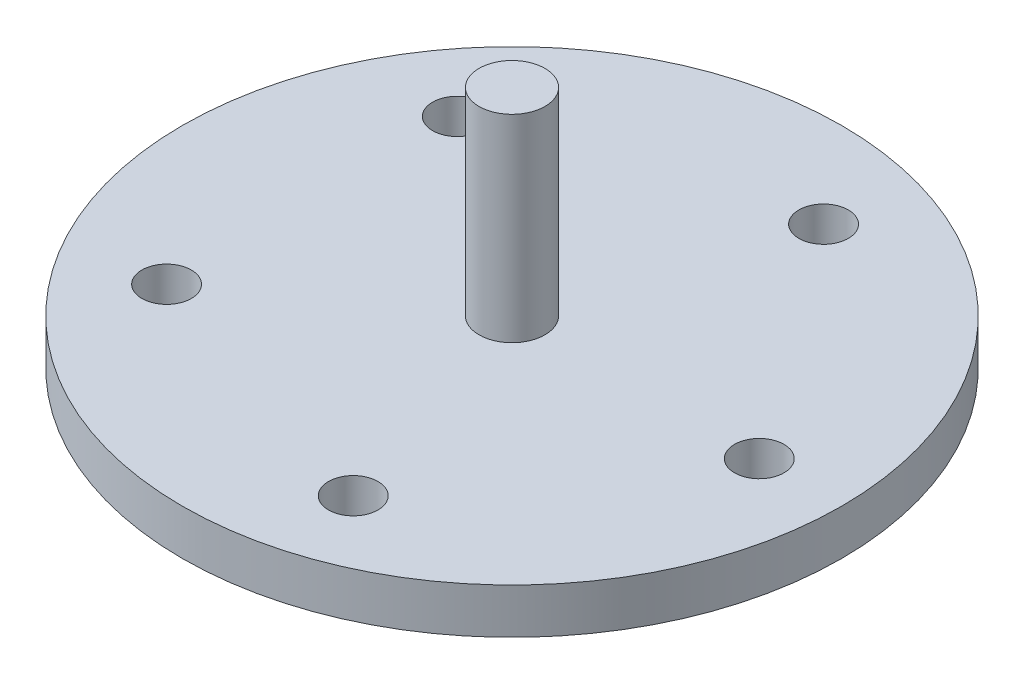
ISO-10303-21;
HEADER;
FILE_DESCRIPTION(('STEP AP214'),'2;1');
FILE_NAME('part.step','',(''),(''),'','','');
FILE_SCHEMA(('AUTOMOTIVE_DESIGN { 1 0 10303 214 1 1 1 1 }'));
ENDSEC;
DATA;
#1=APPLICATION_CONTEXT('core data for automotive mechanical design processes');
#2=APPLICATION_PROTOCOL_DEFINITION('international standard','automotive_design',2000,#1);
#3=PRODUCT_CONTEXT('',#1,'mechanical');
#4=PRODUCT('Part','Part','',(#3));
#5=PRODUCT_RELATED_PRODUCT_CATEGORY('part','',(#4));
#6=PRODUCT_DEFINITION_FORMATION('','',#4);
#7=PRODUCT_DEFINITION_CONTEXT('part definition',#1,'design');
#8=PRODUCT_DEFINITION('design','',#6,#7);
#9=PRODUCT_DEFINITION_SHAPE('','',#8);
#10=(LENGTH_UNIT() NAMED_UNIT(*) SI_UNIT(.MILLI.,.METRE.));
#11=(NAMED_UNIT(*) PLANE_ANGLE_UNIT() SI_UNIT($,.RADIAN.));
#12=(NAMED_UNIT(*) SI_UNIT($,.STERADIAN.) SOLID_ANGLE_UNIT());
#13=UNCERTAINTY_MEASURE_WITH_UNIT(LENGTH_MEASURE(1.E-05),#10,'distance_accuracy_value','');
#14=(GEOMETRIC_REPRESENTATION_CONTEXT(3) GLOBAL_UNCERTAINTY_ASSIGNED_CONTEXT((#13)) GLOBAL_UNIT_ASSIGNED_CONTEXT((#10,
#11,#12)) REPRESENTATION_CONTEXT('',''));
#15=CARTESIAN_POINT('',(0.,0.,0.));
#16=DIRECTION('',(0.,0.,1.));
#17=DIRECTION('',(1.,0.,0.));
#18=AXIS2_PLACEMENT_3D('',#15,#16,#17);
#19=CARTESIAN_POINT('',(0.,5.5,0.));
#20=DIRECTION('',(0.,-1.,0.));
#21=DIRECTION('',(0.,0.,-1.));
#22=AXIS2_PLACEMENT_3D('',#19,#20,#21);
#23=CYLINDRICAL_SURFACE('',#22,40.);
#24=CARTESIAN_POINT('',(0.,5.5,0.));
#25=DIRECTION('',(0.,1.,0.));
#26=DIRECTION('',(0.,0.,1.));
#27=AXIS2_PLACEMENT_3D('',#24,#25,#26);
#28=CIRCLE('',#27,40.);
#29=CARTESIAN_POINT('',(0.,5.5,40.));
#30=VERTEX_POINT('',#29);
#31=EDGE_CURVE('E10',#30,#30,#28,.T.);
#32=ORIENTED_EDGE('',*,*,#31,.F.);
#33=EDGE_LOOP('',(#32));
#34=FACE_BOUND('',#33,.T.);
#35=CARTESIAN_POINT('',(0.,0.,0.));
#36=DIRECTION('',(0.,1.,0.));
#37=DIRECTION('',(0.,0.,1.));
#38=AXIS2_PLACEMENT_3D('',#35,#36,#37);
#39=CIRCLE('',#38,40.);
#40=CARTESIAN_POINT('',(0.,0.,40.));
#41=VERTEX_POINT('',#40);
#42=EDGE_CURVE('E40',#41,#41,#39,.T.);
#43=ORIENTED_EDGE('',*,*,#42,.T.);
#44=EDGE_LOOP('',(#43));
#45=FACE_BOUND('',#44,.T.);
#46=ADVANCED_FACE('F37',(#34,#45),#23,.T.);
#47=CARTESIAN_POINT('',(0.,5.5,0.));
#48=DIRECTION('',(0.,1.,0.));
#49=DIRECTION('',(0.,0.,1.));
#50=AXIS2_PLACEMENT_3D('',#47,#48,#49);
#51=PLANE('',#50);
#52=CARTESIAN_POINT('',(0.,5.5,0.));
#53=DIRECTION('',(0.,1.,0.));
#54=DIRECTION('',(0.,0.,1.));
#55=AXIS2_PLACEMENT_3D('',#52,#53,#54);
#56=CIRCLE('',#55,4.);
#57=CARTESIAN_POINT('',(0.,5.5,4.));
#58=VERTEX_POINT('',#57);
#59=EDGE_CURVE('E91',#58,#58,#56,.T.);
#60=ORIENTED_EDGE('',*,*,#59,.F.);
#61=EDGE_LOOP('',(#60));
#62=FACE_BOUND('',#61,.T.);
#63=CARTESIAN_POINT('',(9.27050983124834,5.5,-28.5316954888546));
#64=DIRECTION('',(0.,1.,0.));
#65=DIRECTION('',(0.951056516295155,0.,0.309016994374945));
#66=AXIS2_PLACEMENT_3D('',#63,#64,#65);
#67=CIRCLE('',#66,3.);
#68=CARTESIAN_POINT('',(12.1236793801338,5.5,-27.6046445057298));
#69=VERTEX_POINT('',#68);
#70=EDGE_CURVE('E84',#69,#69,#67,.T.);
#71=ORIENTED_EDGE('',*,*,#70,.F.);
#72=EDGE_LOOP('',(#71));
#73=FACE_BOUND('',#72,.T.);
#74=CARTESIAN_POINT('',(-24.2705098312485,5.5,-17.6335575687741));
#75=DIRECTION('',(0.,1.,0.));
#76=DIRECTION('',(0.587785252292469,0.,-0.809016994374951));
#77=AXIS2_PLACEMENT_3D('',#74,#75,#76);
#78=CIRCLE('',#77,3.);
#79=CARTESIAN_POINT('',(-22.5071540743711,5.5,-20.0606085518989));
#80=VERTEX_POINT('',#79);
#81=EDGE_CURVE('E76',#80,#80,#78,.T.);
#82=ORIENTED_EDGE('',*,*,#81,.F.);
#83=EDGE_LOOP('',(#82));
#84=FACE_BOUND('',#83,.T.);
#85=CARTESIAN_POINT('',(-24.2705098312483,5.5,17.6335575687744));
#86=DIRECTION('',(0.,1.,0.));
#87=DIRECTION('',(-0.58778525229248,0.,-0.809016994374942));
#88=AXIS2_PLACEMENT_3D('',#85,#86,#87);
#89=CIRCLE('',#88,3.);
#90=CARTESIAN_POINT('',(-26.0338655881257,5.5,15.2065065856496));
#91=VERTEX_POINT('',#90);
#92=EDGE_CURVE('E68',#91,#91,#89,.T.);
#93=ORIENTED_EDGE('',*,*,#92,.F.);
#94=EDGE_LOOP('',(#93));
#95=FACE_BOUND('',#94,.T.);
#96=CARTESIAN_POINT('',(9.27050983124875,5.5,28.5316954888545));
#97=DIRECTION('',(0.,1.,0.));
#98=DIRECTION('',(-0.95105651629515,0.,0.309016994374958));
#99=AXIS2_PLACEMENT_3D('',#96,#97,#98);
#100=CIRCLE('',#99,3.);
#101=CARTESIAN_POINT('',(6.41734028236329,5.5,29.4587464719794));
#102=VERTEX_POINT('',#101);
#103=EDGE_CURVE('E59',#102,#102,#100,.T.);
#104=ORIENTED_EDGE('',*,*,#103,.F.);
#105=EDGE_LOOP('',(#104));
#106=FACE_BOUND('',#105,.T.);
#107=CARTESIAN_POINT('',(30.,5.5,0.));
#108=DIRECTION('',(0.,1.,0.));
#109=DIRECTION('',(0.,0.,1.));
#110=AXIS2_PLACEMENT_3D('',#107,#108,#109);
#111=CIRCLE('',#110,3.);
#112=CARTESIAN_POINT('',(30.,5.5,3.));
#113=VERTEX_POINT('',#112);
#114=EDGE_CURVE('E51',#113,#113,#111,.T.);
#115=ORIENTED_EDGE('',*,*,#114,.F.);
#116=EDGE_LOOP('',(#115));
#117=FACE_BOUND('',#116,.T.);
#118=ORIENTED_EDGE('',*,*,#31,.T.);
#119=EDGE_LOOP('',(#118));
#120=FACE_BOUND('',#119,.T.);
#121=ADVANCED_FACE('F108',(#62,#73,#84,#95,#106,#117,#120),#51,.T.);
#122=CARTESIAN_POINT('',(0.,0.,0.));
#123=DIRECTION('',(0.,1.,0.));
#124=DIRECTION('',(0.,0.,1.));
#125=AXIS2_PLACEMENT_3D('',#122,#123,#124);
#126=PLANE('',#125);
#127=CARTESIAN_POINT('',(9.27050983124834,0.,-28.5316954888546));
#128=DIRECTION('',(0.,1.,0.));
#129=DIRECTION('',(0.951056516295155,0.,0.309016994374945));
#130=AXIS2_PLACEMENT_3D('',#127,#128,#129);
#131=CIRCLE('',#130,3.);
#132=CARTESIAN_POINT('',(12.1236793801338,0.,-27.6046445057298));
#133=VERTEX_POINT('',#132);
#134=EDGE_CURVE('E55',#133,#133,#131,.T.);
#135=ORIENTED_EDGE('',*,*,#134,.T.);
#136=EDGE_LOOP('',(#135));
#137=FACE_BOUND('',#136,.T.);
#138=CARTESIAN_POINT('',(-24.2705098312485,0.,-17.6335575687741));
#139=DIRECTION('',(0.,1.,0.));
#140=DIRECTION('',(0.587785252292469,0.,-0.809016994374951));
#141=AXIS2_PLACEMENT_3D('',#138,#139,#140);
#142=CIRCLE('',#141,3.);
#143=CARTESIAN_POINT('',(-22.5071540743711,0.,-20.0606085518989));
#144=VERTEX_POINT('',#143);
#145=EDGE_CURVE('E80',#144,#144,#142,.T.);
#146=ORIENTED_EDGE('',*,*,#145,.T.);
#147=EDGE_LOOP('',(#146));
#148=FACE_BOUND('',#147,.T.);
#149=CARTESIAN_POINT('',(-24.2705098312483,0.,17.6335575687744));
#150=DIRECTION('',(0.,1.,0.));
#151=DIRECTION('',(-0.58778525229248,0.,-0.809016994374942));
#152=AXIS2_PLACEMENT_3D('',#149,#150,#151);
#153=CIRCLE('',#152,3.);
#154=CARTESIAN_POINT('',(-26.0338655881257,0.,15.2065065856496));
#155=VERTEX_POINT('',#154);
#156=EDGE_CURVE('E72',#155,#155,#153,.T.);
#157=ORIENTED_EDGE('',*,*,#156,.T.);
#158=EDGE_LOOP('',(#157));
#159=FACE_BOUND('',#158,.T.);
#160=CARTESIAN_POINT('',(9.27050983124875,0.,28.5316954888545));
#161=DIRECTION('',(0.,1.,0.));
#162=DIRECTION('',(-0.95105651629515,0.,0.309016994374958));
#163=AXIS2_PLACEMENT_3D('',#160,#161,#162);
#164=CIRCLE('',#163,3.);
#165=CARTESIAN_POINT('',(6.41734028236329,0.,29.4587464719794));
#166=VERTEX_POINT('',#165);
#167=EDGE_CURVE('E63',#166,#166,#164,.T.);
#168=ORIENTED_EDGE('',*,*,#167,.T.);
#169=EDGE_LOOP('',(#168));
#170=FACE_BOUND('',#169,.T.);
#171=CARTESIAN_POINT('',(30.,0.,0.));
#172=DIRECTION('',(0.,1.,0.));
#173=DIRECTION('',(0.,0.,1.));
#174=AXIS2_PLACEMENT_3D('',#171,#172,#173);
#175=CIRCLE('',#174,3.);
#176=CARTESIAN_POINT('',(30.,0.,3.));
#177=VERTEX_POINT('',#176);
#178=EDGE_CURVE('E49',#177,#177,#175,.T.);
#179=ORIENTED_EDGE('',*,*,#178,.T.);
#180=EDGE_LOOP('',(#179));
#181=FACE_BOUND('',#180,.T.);
#182=ORIENTED_EDGE('',*,*,#42,.F.);
#183=EDGE_LOOP('',(#182));
#184=FACE_BOUND('',#183,.T.);
#185=ADVANCED_FACE('F111',(#137,#148,#159,#170,#181,#184),#126,.F.);
#186=CARTESIAN_POINT('',(30.,0.,0.));
#187=DIRECTION('',(0.,1.,0.));
#188=DIRECTION('',(0.,0.,1.));
#189=AXIS2_PLACEMENT_3D('',#186,#187,#188);
#190=CYLINDRICAL_SURFACE('',#189,3.);
#191=ORIENTED_EDGE('',*,*,#178,.F.);
#192=EDGE_LOOP('',(#191));
#193=FACE_BOUND('',#192,.T.);
#194=ORIENTED_EDGE('',*,*,#114,.T.);
#195=EDGE_LOOP('',(#194));
#196=FACE_BOUND('',#195,.T.);
#197=ADVANCED_FACE('F123',(#193,#196),#190,.F.);
#198=CARTESIAN_POINT('',(9.27050983124875,0.,28.5316954888545));
#199=DIRECTION('',(0.,1.,0.));
#200=DIRECTION('',(0.,0.,1.));
#201=AXIS2_PLACEMENT_3D('',#198,#199,#200);
#202=CYLINDRICAL_SURFACE('',#201,3.);
#203=ORIENTED_EDGE('',*,*,#167,.F.);
#204=EDGE_LOOP('',(#203));
#205=FACE_BOUND('',#204,.T.);
#206=ORIENTED_EDGE('',*,*,#103,.T.);
#207=EDGE_LOOP('',(#206));
#208=FACE_BOUND('',#207,.T.);
#209=ADVANCED_FACE('F125',(#205,#208),#202,.F.);
#210=CARTESIAN_POINT('',(-24.2705098312483,0.,17.6335575687744));
#211=DIRECTION('',(0.,1.,0.));
#212=DIRECTION('',(0.,0.,1.));
#213=AXIS2_PLACEMENT_3D('',#210,#211,#212);
#214=CYLINDRICAL_SURFACE('',#213,3.);
#215=ORIENTED_EDGE('',*,*,#156,.F.);
#216=EDGE_LOOP('',(#215));
#217=FACE_BOUND('',#216,.T.);
#218=ORIENTED_EDGE('',*,*,#92,.T.);
#219=EDGE_LOOP('',(#218));
#220=FACE_BOUND('',#219,.T.);
#221=ADVANCED_FACE('F132',(#217,#220),#214,.F.);
#222=CARTESIAN_POINT('',(-24.2705098312485,0.,-17.6335575687741));
#223=DIRECTION('',(0.,1.,0.));
#224=DIRECTION('',(0.,0.,1.));
#225=AXIS2_PLACEMENT_3D('',#222,#223,#224);
#226=CYLINDRICAL_SURFACE('',#225,3.);
#227=ORIENTED_EDGE('',*,*,#145,.F.);
#228=EDGE_LOOP('',(#227));
#229=FACE_BOUND('',#228,.T.);
#230=ORIENTED_EDGE('',*,*,#81,.T.);
#231=EDGE_LOOP('',(#230));
#232=FACE_BOUND('',#231,.T.);
#233=ADVANCED_FACE('F171',(#229,#232),#226,.F.);
#234=CARTESIAN_POINT('',(9.27050983124834,0.,-28.5316954888546));
#235=DIRECTION('',(0.,1.,0.));
#236=DIRECTION('',(0.,0.,1.));
#237=AXIS2_PLACEMENT_3D('',#234,#235,#236);
#238=CYLINDRICAL_SURFACE('',#237,3.);
#239=ORIENTED_EDGE('',*,*,#134,.F.);
#240=EDGE_LOOP('',(#239));
#241=FACE_BOUND('',#240,.T.);
#242=ORIENTED_EDGE('',*,*,#70,.T.);
#243=EDGE_LOOP('',(#242));
#244=FACE_BOUND('',#243,.T.);
#245=ADVANCED_FACE('F104',(#241,#244),#238,.F.);
#246=CARTESIAN_POINT('',(0.,29.5,0.));
#247=DIRECTION('',(0.,-1.,0.));
#248=DIRECTION('',(0.,0.,-1.));
#249=AXIS2_PLACEMENT_3D('',#246,#247,#248);
#250=CYLINDRICAL_SURFACE('',#249,4.);
#251=CARTESIAN_POINT('',(0.,29.5,0.));
#252=DIRECTION('',(0.,1.,0.));
#253=DIRECTION('',(0.,0.,1.));
#254=AXIS2_PLACEMENT_3D('',#251,#252,#253);
#255=CIRCLE('',#254,4.);
#256=CARTESIAN_POINT('',(0.,29.5,4.));
#257=VERTEX_POINT('',#256);
#258=EDGE_CURVE('E64',#257,#257,#255,.T.);
#259=ORIENTED_EDGE('',*,*,#258,.F.);
#260=EDGE_LOOP('',(#259));
#261=FACE_BOUND('',#260,.T.);
#262=ORIENTED_EDGE('',*,*,#59,.T.);
#263=EDGE_LOOP('',(#262));
#264=FACE_BOUND('',#263,.T.);
#265=ADVANCED_FACE('F101',(#261,#264),#250,.T.);
#266=CARTESIAN_POINT('',(0.,29.5,0.));
#267=DIRECTION('',(0.,1.,0.));
#268=DIRECTION('',(0.,0.,1.));
#269=AXIS2_PLACEMENT_3D('',#266,#267,#268);
#270=PLANE('',#269);
#271=ORIENTED_EDGE('',*,*,#258,.T.);
#272=EDGE_LOOP('',(#271));
#273=FACE_BOUND('',#272,.T.);
#274=ADVANCED_FACE('F99',(#273),#270,.T.);
#275=CLOSED_SHELL('',(#46,#121,#185,#197,#209,#221,#233,#245,#265,#274));
#276=MANIFOLD_SOLID_BREP('B2',#275);
#277=ADVANCED_BREP_SHAPE_REPRESENTATION('',(#18,#276),#14);
#278=SHAPE_DEFINITION_REPRESENTATION(#9,#277);
ENDSEC;
END-ISO-10303-21;
